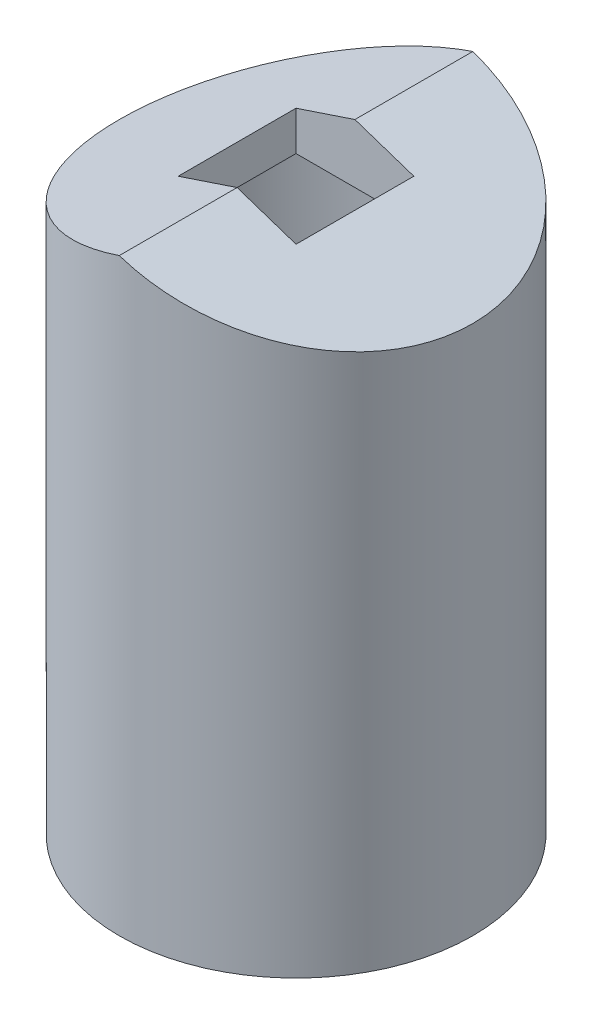
ISO-10303-21;
HEADER;
FILE_DESCRIPTION(('STEP AP214'),'2;1');
FILE_NAME('part.step','',(''),(''),'','','');
FILE_SCHEMA(('AUTOMOTIVE_DESIGN { 1 0 10303 214 1 1 1 1 }'));
ENDSEC;
DATA;
#1=APPLICATION_CONTEXT('core data for automotive mechanical design processes');
#2=APPLICATION_PROTOCOL_DEFINITION('international standard','automotive_design',2000,#1);
#3=PRODUCT_CONTEXT('',#1,'mechanical');
#4=PRODUCT('Part','Part','',(#3));
#5=PRODUCT_RELATED_PRODUCT_CATEGORY('part','',(#4));
#6=PRODUCT_DEFINITION_FORMATION('','',#4);
#7=PRODUCT_DEFINITION_CONTEXT('part definition',#1,'design');
#8=PRODUCT_DEFINITION('design','',#6,#7);
#9=PRODUCT_DEFINITION_SHAPE('','',#8);
#10=(LENGTH_UNIT() NAMED_UNIT(*) SI_UNIT(.MILLI.,.METRE.));
#11=(NAMED_UNIT(*) PLANE_ANGLE_UNIT() SI_UNIT($,.RADIAN.));
#12=(NAMED_UNIT(*) SI_UNIT($,.STERADIAN.) SOLID_ANGLE_UNIT());
#13=UNCERTAINTY_MEASURE_WITH_UNIT(LENGTH_MEASURE(1.E-05),#10,'distance_accuracy_value','');
#14=(GEOMETRIC_REPRESENTATION_CONTEXT(3) GLOBAL_UNCERTAINTY_ASSIGNED_CONTEXT((#13)) GLOBAL_UNIT_ASSIGNED_CONTEXT((#10,
#11,#12)) REPRESENTATION_CONTEXT('',''));
#15=CARTESIAN_POINT('',(0.,0.,0.));
#16=DIRECTION('',(0.,0.,1.));
#17=DIRECTION('',(1.,0.,0.));
#18=AXIS2_PLACEMENT_3D('',#15,#16,#17);
#19=CARTESIAN_POINT('',(-3.,32.,3.));
#20=DIRECTION('',(-1.,0.,0.));
#21=DIRECTION('',(0.,0.,1.));
#22=AXIS2_PLACEMENT_3D('',#19,#20,#21);
#23=PLANE('',#22);
#24=DIRECTION('',(0.,0.,1.));
#25=VECTOR('',#24,1.);
#26=CARTESIAN_POINT('',(-3.,27.,3.));
#27=LINE('',#26,#25);
#28=CARTESIAN_POINT('',(-3.,27.,-3.));
#29=VERTEX_POINT('',#28);
#30=CARTESIAN_POINT('',(-3.,27.,3.));
#31=VERTEX_POINT('',#30);
#32=EDGE_CURVE('E54',#29,#31,#27,.T.);
#33=ORIENTED_EDGE('',*,*,#32,.F.);
#34=DIRECTION('',(0.,-1.,0.));
#35=VECTOR('',#34,1.);
#36=CARTESIAN_POINT('',(-3.,32.,-3.));
#37=LINE('',#36,#35);
#38=CARTESIAN_POINT('',(-3.,29.,-3.));
#39=VERTEX_POINT('',#38);
#40=EDGE_CURVE('E109',#39,#29,#37,.T.);
#41=ORIENTED_EDGE('',*,*,#40,.F.);
#42=DIRECTION('',(0.,0.,-1.));
#43=VECTOR('',#42,1.);
#44=CARTESIAN_POINT('',(-3.,29.,9.));
#45=LINE('',#44,#43);
#46=CARTESIAN_POINT('',(-3.,29.,3.));
#47=VERTEX_POINT('',#46);
#48=EDGE_CURVE('E118',#47,#39,#45,.T.);
#49=ORIENTED_EDGE('',*,*,#48,.F.);
#50=DIRECTION('',(0.,-1.,0.));
#51=VECTOR('',#50,1.);
#52=CARTESIAN_POINT('',(-3.,32.,3.));
#53=LINE('',#52,#51);
#54=EDGE_CURVE('E61',#47,#31,#53,.T.);
#55=ORIENTED_EDGE('',*,*,#54,.T.);
#56=EDGE_LOOP('',(#33,#41,#49,#55));
#57=FACE_BOUND('',#56,.T.);
#58=ADVANCED_FACE('F40',(#57),#23,.F.);
#59=CARTESIAN_POINT('',(3.,32.,3.));
#60=DIRECTION('',(1.,0.,0.));
#61=DIRECTION('',(0.,0.,-1.));
#62=AXIS2_PLACEMENT_3D('',#59,#60,#61);
#63=PLANE('',#62);
#64=DIRECTION('',(0.,0.,-1.));
#65=VECTOR('',#64,1.);
#66=CARTESIAN_POINT('',(3.,27.,3.));
#67=LINE('',#66,#65);
#68=CARTESIAN_POINT('',(3.,27.,3.));
#69=VERTEX_POINT('',#68);
#70=CARTESIAN_POINT('',(3.,27.,-3.));
#71=VERTEX_POINT('',#70);
#72=EDGE_CURVE('E91',#69,#71,#67,.T.);
#73=ORIENTED_EDGE('',*,*,#72,.F.);
#74=DIRECTION('',(0.,-1.,0.));
#75=VECTOR('',#74,1.);
#76=CARTESIAN_POINT('',(3.,32.,3.));
#77=LINE('',#76,#75);
#78=CARTESIAN_POINT('',(3.,29.,3.));
#79=VERTEX_POINT('',#78);
#80=EDGE_CURVE('E98',#79,#69,#77,.T.);
#81=ORIENTED_EDGE('',*,*,#80,.F.);
#82=DIRECTION('',(0.,0.,-1.));
#83=VECTOR('',#82,1.);
#84=CARTESIAN_POINT('',(3.,29.,9.));
#85=LINE('',#84,#83);
#86=CARTESIAN_POINT('',(3.,29.,-3.));
#87=VERTEX_POINT('',#86);
#88=EDGE_CURVE('E126',#79,#87,#85,.T.);
#89=ORIENTED_EDGE('',*,*,#88,.T.);
#90=DIRECTION('',(0.,-1.,0.));
#91=VECTOR('',#90,1.);
#92=CARTESIAN_POINT('',(3.,32.,-3.));
#93=LINE('',#92,#91);
#94=EDGE_CURVE('E101',#87,#71,#93,.T.);
#95=ORIENTED_EDGE('',*,*,#94,.T.);
#96=EDGE_LOOP('',(#73,#81,#89,#95));
#97=FACE_BOUND('',#96,.T.);
#98=ADVANCED_FACE('F97',(#97),#63,.F.);
#99=CARTESIAN_POINT('',(-3.,32.,-3.));
#100=DIRECTION('',(0.,0.,-1.));
#101=DIRECTION('',(-1.,0.,0.));
#102=AXIS2_PLACEMENT_3D('',#99,#100,#101);
#103=PLANE('',#102);
#104=DIRECTION('',(-1.,0.,0.));
#105=VECTOR('',#104,1.);
#106=CARTESIAN_POINT('',(-3.,27.,-3.));
#107=LINE('',#106,#105);
#108=EDGE_CURVE('E107',#71,#29,#107,.T.);
#109=ORIENTED_EDGE('',*,*,#108,.F.);
#110=ORIENTED_EDGE('',*,*,#94,.F.);
#111=DIRECTION('',(-0.948683298050514,0.316227766016838,0.));
#112=VECTOR('',#111,1.);
#113=CARTESIAN_POINT('',(9.,27.,-3.));
#114=LINE('',#113,#112);
#115=CARTESIAN_POINT('',(0.,30.,-3.));
#116=VERTEX_POINT('',#115);
#117=EDGE_CURVE('E124',#87,#116,#114,.T.);
#118=ORIENTED_EDGE('',*,*,#117,.T.);
#119=DIRECTION('',(0.948683298050514,0.316227766016838,0.));
#120=VECTOR('',#119,1.);
#121=CARTESIAN_POINT('',(-9.,27.,-3.));
#122=LINE('',#121,#120);
#123=EDGE_CURVE('E121',#39,#116,#122,.T.);
#124=ORIENTED_EDGE('',*,*,#123,.F.);
#125=ORIENTED_EDGE('',*,*,#40,.T.);
#126=EDGE_LOOP('',(#109,#110,#118,#124,#125));
#127=FACE_BOUND('',#126,.T.);
#128=ADVANCED_FACE('F159',(#127),#103,.F.);
#129=CARTESIAN_POINT('',(-3.,32.,3.));
#130=DIRECTION('',(0.,0.,1.));
#131=DIRECTION('',(1.,0.,0.));
#132=AXIS2_PLACEMENT_3D('',#129,#130,#131);
#133=PLANE('',#132);
#134=DIRECTION('',(1.,0.,0.));
#135=VECTOR('',#134,1.);
#136=CARTESIAN_POINT('',(-3.,27.,3.));
#137=LINE('',#136,#135);
#138=EDGE_CURVE('E11',#31,#69,#137,.T.);
#139=ORIENTED_EDGE('',*,*,#138,.F.);
#140=ORIENTED_EDGE('',*,*,#54,.F.);
#141=DIRECTION('',(-0.948683298050514,-0.316227766016838,0.));
#142=VECTOR('',#141,1.);
#143=CARTESIAN_POINT('',(-9.,27.,3.));
#144=LINE('',#143,#142);
#145=CARTESIAN_POINT('',(0.,30.,3.));
#146=VERTEX_POINT('',#145);
#147=EDGE_CURVE('E114',#146,#47,#144,.T.);
#148=ORIENTED_EDGE('',*,*,#147,.F.);
#149=DIRECTION('',(0.948683298050514,-0.316227766016838,0.));
#150=VECTOR('',#149,1.);
#151=CARTESIAN_POINT('',(9.,27.,3.));
#152=LINE('',#151,#150);
#153=EDGE_CURVE('E106',#146,#79,#152,.T.);
#154=ORIENTED_EDGE('',*,*,#153,.T.);
#155=ORIENTED_EDGE('',*,*,#80,.T.);
#156=EDGE_LOOP('',(#139,#140,#148,#154,#155));
#157=FACE_BOUND('',#156,.T.);
#158=ADVANCED_FACE('F104',(#157),#133,.F.);
#159=CARTESIAN_POINT('',(9.,27.,9.));
#160=DIRECTION('',(0.316227766016838,0.948683298050514,0.));
#161=DIRECTION('',(-0.948683298050514,0.316227766016838,0.));
#162=AXIS2_PLACEMENT_3D('',#159,#160,#161);
#163=PLANE('',#162);
#164=ORIENTED_EDGE('',*,*,#117,.F.);
#165=ORIENTED_EDGE('',*,*,#88,.F.);
#166=ORIENTED_EDGE('',*,*,#153,.F.);
#167=DIRECTION('',(0.,0.,-1.));
#168=VECTOR('',#167,1.);
#169=CARTESIAN_POINT('',(0.,30.,9.));
#170=LINE('',#169,#168);
#171=CARTESIAN_POINT('',(0.,30.,9.));
#172=VERTEX_POINT('',#171);
#173=EDGE_CURVE('E135',#172,#146,#170,.T.);
#174=ORIENTED_EDGE('',*,*,#173,.F.);
#175=CARTESIAN_POINT('',(0.,30.,0.));
#176=DIRECTION('',(0.316227766016838,0.948683298050514,0.));
#177=DIRECTION('',(0.948683298050514,-0.316227766016838,0.));
#178=AXIS2_PLACEMENT_3D('',#175,#176,#177);
#179=ELLIPSE('',#178,9.48683298050514,9.);
#180=CARTESIAN_POINT('',(0.,30.,-9.));
#181=VERTEX_POINT('',#180);
#182=EDGE_CURVE('E131',#172,#181,#179,.T.);
#183=ORIENTED_EDGE('',*,*,#182,.T.);
#184=EDGE_CURVE('E134',#116,#181,#170,.T.);
#185=ORIENTED_EDGE('',*,*,#184,.F.);
#186=EDGE_LOOP('',(#164,#165,#166,#174,#183,#185));
#187=FACE_BOUND('',#186,.T.);
#188=ADVANCED_FACE('F165',(#187),#163,.T.);
#189=CARTESIAN_POINT('',(-9.,27.,9.));
#190=DIRECTION('',(0.316227766016838,-0.948683298050514,0.));
#191=DIRECTION('',(0.948683298050514,0.316227766016838,0.));
#192=AXIS2_PLACEMENT_3D('',#189,#190,#191);
#193=PLANE('',#192);
#194=ORIENTED_EDGE('',*,*,#48,.T.);
#195=ORIENTED_EDGE('',*,*,#123,.T.);
#196=ORIENTED_EDGE('',*,*,#184,.T.);
#197=CARTESIAN_POINT('',(0.,30.,0.));
#198=DIRECTION('',(0.316227766016838,-0.948683298050514,0.));
#199=DIRECTION('',(-0.948683298050514,-0.316227766016838,0.));
#200=AXIS2_PLACEMENT_3D('',#197,#198,#199);
#201=ELLIPSE('',#200,9.48683298050514,9.);
#202=EDGE_CURVE('E128',#172,#181,#201,.T.);
#203=ORIENTED_EDGE('',*,*,#202,.F.);
#204=ORIENTED_EDGE('',*,*,#173,.T.);
#205=ORIENTED_EDGE('',*,*,#147,.T.);
#206=EDGE_LOOP('',(#194,#195,#196,#203,#204,#205));
#207=FACE_BOUND('',#206,.T.);
#208=ADVANCED_FACE('F151',(#207),#193,.F.);
#209=CARTESIAN_POINT('',(9.,0.,0.));
#210=DIRECTION('',(0.,-1.,0.));
#211=DIRECTION('',(0.,0.,-1.));
#212=AXIS2_PLACEMENT_3D('',#209,#210,#211);
#213=PLANE('',#212);
#214=CARTESIAN_POINT('',(0.,0.,0.));
#215=DIRECTION('',(0.,-1.,0.));
#216=DIRECTION('',(0.,0.,-1.));
#217=AXIS2_PLACEMENT_3D('',#214,#215,#216);
#218=CIRCLE('',#217,8.);
#219=CARTESIAN_POINT('',(0.,0.,-8.));
#220=VERTEX_POINT('',#219);
#221=EDGE_CURVE('E183',#220,#220,#218,.T.);
#222=ORIENTED_EDGE('',*,*,#221,.F.);
#223=EDGE_LOOP('',(#222));
#224=FACE_BOUND('',#223,.T.);
#225=CARTESIAN_POINT('',(0.,0.,0.));
#226=DIRECTION('',(0.,-1.,0.));
#227=DIRECTION('',(0.,0.,-1.));
#228=AXIS2_PLACEMENT_3D('',#225,#226,#227);
#229=CIRCLE('',#228,9.);
#230=CARTESIAN_POINT('',(0.,0.,-9.));
#231=VERTEX_POINT('',#230);
#232=EDGE_CURVE('E48',#231,#231,#229,.T.);
#233=ORIENTED_EDGE('',*,*,#232,.T.);
#234=EDGE_LOOP('',(#233));
#235=FACE_BOUND('',#234,.T.);
#236=ADVANCED_FACE('F140',(#224,#235),#213,.T.);
#237=CARTESIAN_POINT('',(0.,0.,0.));
#238=DIRECTION('',(0.,-1.,0.));
#239=DIRECTION('',(0.,0.,-1.));
#240=AXIS2_PLACEMENT_3D('',#237,#238,#239);
#241=CYLINDRICAL_SURFACE('',#240,9.);
#242=ORIENTED_EDGE('',*,*,#202,.T.);
#243=ORIENTED_EDGE('',*,*,#182,.F.);
#244=EDGE_LOOP('',(#242,#243));
#245=FACE_BOUND('',#244,.T.);
#246=ORIENTED_EDGE('',*,*,#232,.F.);
#247=EDGE_LOOP('',(#246));
#248=FACE_BOUND('',#247,.T.);
#249=ADVANCED_FACE('F42',(#245,#248),#241,.T.);
#250=CARTESIAN_POINT('',(0.,27.,0.));
#251=DIRECTION('',(0.,-1.,0.));
#252=DIRECTION('',(0.,0.,-1.));
#253=AXIS2_PLACEMENT_3D('',#250,#251,#252);
#254=PLANE('',#253);
#255=CARTESIAN_POINT('',(0.,27.,0.));
#256=DIRECTION('',(0.,-1.,0.));
#257=DIRECTION('',(0.,0.,-1.));
#258=AXIS2_PLACEMENT_3D('',#255,#256,#257);
#259=CIRCLE('',#258,8.);
#260=CARTESIAN_POINT('',(0.,27.,-8.));
#261=VERTEX_POINT('',#260);
#262=EDGE_CURVE('E102',#261,#261,#259,.T.);
#263=ORIENTED_EDGE('',*,*,#262,.T.);
#264=EDGE_LOOP('',(#263));
#265=FACE_BOUND('',#264,.T.);
#266=ORIENTED_EDGE('',*,*,#108,.T.);
#267=ORIENTED_EDGE('',*,*,#32,.T.);
#268=ORIENTED_EDGE('',*,*,#138,.T.);
#269=ORIENTED_EDGE('',*,*,#72,.T.);
#270=EDGE_LOOP('',(#266,#267,#268,#269));
#271=FACE_BOUND('',#270,.T.);
#272=ADVANCED_FACE('F90',(#265,#271),#254,.T.);
#273=CARTESIAN_POINT('',(0.,27.,0.));
#274=DIRECTION('',(0.,-1.,0.));
#275=DIRECTION('',(0.,0.,-1.));
#276=AXIS2_PLACEMENT_3D('',#273,#274,#275);
#277=CYLINDRICAL_SURFACE('',#276,8.);
#278=ORIENTED_EDGE('',*,*,#262,.F.);
#279=EDGE_LOOP('',(#278));
#280=FACE_BOUND('',#279,.T.);
#281=ORIENTED_EDGE('',*,*,#221,.T.);
#282=EDGE_LOOP('',(#281));
#283=FACE_BOUND('',#282,.T.);
#284=ADVANCED_FACE('F148',(#280,#283),#277,.F.);
#285=CLOSED_SHELL('',(#58,#98,#128,#158,#188,#208,#236,#249,#272,#284));
#286=MANIFOLD_SOLID_BREP('B2',#285);
#287=ADVANCED_BREP_SHAPE_REPRESENTATION('',(#18,#286),#14);
#288=SHAPE_DEFINITION_REPRESENTATION(#9,#287);
ENDSEC;
END-ISO-10303-21;
